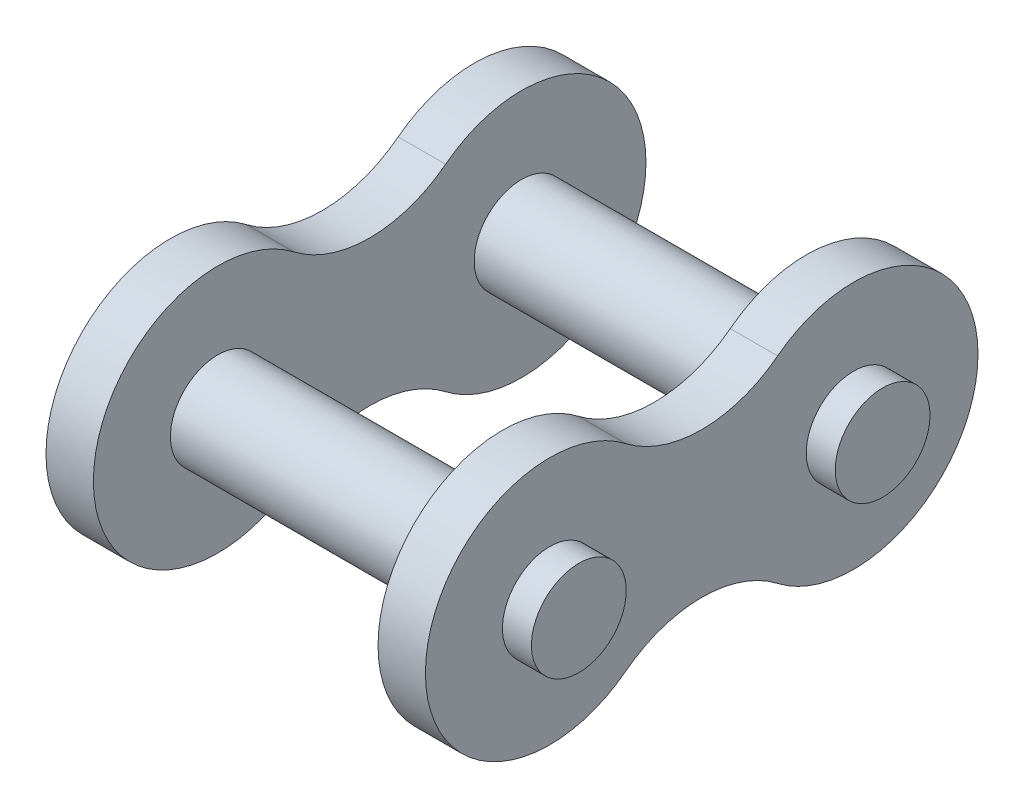
ISO-10303-21;
HEADER;
FILE_DESCRIPTION(('STEP AP214'),'2;1');
FILE_NAME('part.step','',(''),(''),'','','');
FILE_SCHEMA(('AUTOMOTIVE_DESIGN { 1 0 10303 214 1 1 1 1 }'));
ENDSEC;
DATA;
#1=APPLICATION_CONTEXT('core data for automotive mechanical design processes');
#2=APPLICATION_PROTOCOL_DEFINITION('international standard','automotive_design',2000,#1);
#3=PRODUCT_CONTEXT('',#1,'mechanical');
#4=PRODUCT('Part','Part','',(#3));
#5=PRODUCT_RELATED_PRODUCT_CATEGORY('part','',(#4));
#6=PRODUCT_DEFINITION_FORMATION('','',#4);
#7=PRODUCT_DEFINITION_CONTEXT('part definition',#1,'design');
#8=PRODUCT_DEFINITION('design','',#6,#7);
#9=PRODUCT_DEFINITION_SHAPE('','',#8);
#10=(LENGTH_UNIT() NAMED_UNIT(*) SI_UNIT(.MILLI.,.METRE.));
#11=(NAMED_UNIT(*) PLANE_ANGLE_UNIT() SI_UNIT($,.RADIAN.));
#12=(NAMED_UNIT(*) SI_UNIT($,.STERADIAN.) SOLID_ANGLE_UNIT());
#13=UNCERTAINTY_MEASURE_WITH_UNIT(LENGTH_MEASURE(1.E-05),#10,'distance_accuracy_value','');
#14=(GEOMETRIC_REPRESENTATION_CONTEXT(3) GLOBAL_UNCERTAINTY_ASSIGNED_CONTEXT((#13)) GLOBAL_UNIT_ASSIGNED_CONTEXT((#10,
#11,#12)) REPRESENTATION_CONTEXT('',''));
#15=CARTESIAN_POINT('',(0.,0.,0.));
#16=DIRECTION('',(0.,0.,1.));
#17=DIRECTION('',(1.,0.,0.));
#18=AXIS2_PLACEMENT_3D('',#15,#16,#17);
#19=CARTESIAN_POINT('',(-18.288,0.,12.7));
#20=DIRECTION('',(1.,0.,0.));
#21=DIRECTION('',(0.,0.,-1.));
#22=AXIS2_PLACEMENT_3D('',#19,#20,#21);
#23=CYLINDRICAL_SURFACE('',#22,3.9624);
#24=CARTESIAN_POINT('',(-18.288,0.,12.7));
#25=DIRECTION('',(1.,0.,0.));
#26=DIRECTION('',(0.,0.,-1.));
#27=AXIS2_PLACEMENT_3D('',#24,#25,#26);
#28=CIRCLE('',#27,3.9624);
#29=CARTESIAN_POINT('',(-18.288,0.,8.7376));
#30=VERTEX_POINT('',#29);
#31=EDGE_CURVE('E11',#30,#30,#28,.T.);
#32=ORIENTED_EDGE('',*,*,#31,.T.);
#33=EDGE_LOOP('',(#32));
#34=FACE_BOUND('',#33,.T.);
#35=CARTESIAN_POINT('',(18.288,0.,12.7));
#36=DIRECTION('',(1.,0.,0.));
#37=DIRECTION('',(0.,0.,-1.));
#38=AXIS2_PLACEMENT_3D('',#35,#36,#37);
#39=CIRCLE('',#38,3.9624);
#40=CARTESIAN_POINT('',(18.288,0.,8.7376));
#41=VERTEX_POINT('',#40);
#42=EDGE_CURVE('E55',#41,#41,#39,.T.);
#43=ORIENTED_EDGE('',*,*,#42,.F.);
#44=EDGE_LOOP('',(#43));
#45=FACE_BOUND('',#44,.T.);
#46=ADVANCED_FACE('F49',(#34,#45),#23,.T.);
#47=CARTESIAN_POINT('',(-18.288,0.,12.7));
#48=DIRECTION('',(1.,0.,0.));
#49=DIRECTION('',(0.,0.,-1.));
#50=AXIS2_PLACEMENT_3D('',#47,#48,#49);
#51=PLANE('',#50);
#52=ORIENTED_EDGE('',*,*,#31,.F.);
#53=EDGE_LOOP('',(#52));
#54=FACE_BOUND('',#53,.T.);
#55=ADVANCED_FACE('F65',(#54),#51,.F.);
#56=CARTESIAN_POINT('',(18.288,0.,12.7));
#57=DIRECTION('',(1.,0.,0.));
#58=DIRECTION('',(0.,0.,-1.));
#59=AXIS2_PLACEMENT_3D('',#56,#57,#58);
#60=PLANE('',#59);
#61=ORIENTED_EDGE('',*,*,#42,.T.);
#62=EDGE_LOOP('',(#61));
#63=FACE_BOUND('',#62,.T.);
#64=ADVANCED_FACE('F62',(#63),#60,.T.);
#65=CLOSED_SHELL('',(#46,#55,#64));
#66=MANIFOLD_SOLID_BREP('B2',#65);
#67=CARTESIAN_POINT('',(-18.288,0.,-12.7));
#68=DIRECTION('',(1.,0.,0.));
#69=DIRECTION('',(0.,0.,-1.));
#70=AXIS2_PLACEMENT_3D('',#67,#68,#69);
#71=CYLINDRICAL_SURFACE('',#70,3.9624);
#72=CARTESIAN_POINT('',(-18.288,0.,-12.7));
#73=DIRECTION('',(1.,0.,0.));
#74=DIRECTION('',(0.,0.,-1.));
#75=AXIS2_PLACEMENT_3D('',#72,#73,#74);
#76=CIRCLE('',#75,3.9624);
#77=CARTESIAN_POINT('',(-18.288,0.,-16.6624));
#78=VERTEX_POINT('',#77);
#79=EDGE_CURVE('E48',#78,#78,#76,.T.);
#80=ORIENTED_EDGE('',*,*,#79,.T.);
#81=EDGE_LOOP('',(#80));
#82=FACE_BOUND('',#81,.T.);
#83=CARTESIAN_POINT('',(18.288,0.,-12.7));
#84=DIRECTION('',(1.,0.,0.));
#85=DIRECTION('',(0.,0.,-1.));
#86=AXIS2_PLACEMENT_3D('',#83,#84,#85);
#87=CIRCLE('',#86,3.9624);
#88=CARTESIAN_POINT('',(18.288,0.,-16.6624));
#89=VERTEX_POINT('',#88);
#90=EDGE_CURVE('E106',#89,#89,#87,.T.);
#91=ORIENTED_EDGE('',*,*,#90,.F.);
#92=EDGE_LOOP('',(#91));
#93=FACE_BOUND('',#92,.T.);
#94=ADVANCED_FACE('F100',(#82,#93),#71,.T.);
#95=CARTESIAN_POINT('',(-18.288,0.,-12.7));
#96=DIRECTION('',(1.,0.,0.));
#97=DIRECTION('',(0.,0.,-1.));
#98=AXIS2_PLACEMENT_3D('',#95,#96,#97);
#99=PLANE('',#98);
#100=ORIENTED_EDGE('',*,*,#79,.F.);
#101=EDGE_LOOP('',(#100));
#102=FACE_BOUND('',#101,.T.);
#103=ADVANCED_FACE('F116',(#102),#99,.F.);
#104=CARTESIAN_POINT('',(18.288,0.,-12.7));
#105=DIRECTION('',(1.,0.,0.));
#106=DIRECTION('',(0.,0.,-1.));
#107=AXIS2_PLACEMENT_3D('',#104,#105,#106);
#108=PLANE('',#107);
#109=ORIENTED_EDGE('',*,*,#90,.T.);
#110=EDGE_LOOP('',(#109));
#111=FACE_BOUND('',#110,.T.);
#112=ADVANCED_FACE('F113',(#111),#108,.T.);
#113=CLOSED_SHELL('',(#94,#103,#112));
#114=MANIFOLD_SOLID_BREP('B6',#113);
#115=CARTESIAN_POINT('',(15.8623,-8.23799379035941,6.35));
#116=DIRECTION('',(1.,0.,0.));
#117=DIRECTION('',(0.,0.,-1.));
#118=AXIS2_PLACEMENT_3D('',#115,#116,#117);
#119=PLANE('',#118);
#120=CARTESIAN_POINT('',(15.8623,0.,12.7));
#121=DIRECTION('',(1.,0.,0.));
#122=DIRECTION('',(0.,0.,-1.));
#123=AXIS2_PLACEMENT_3D('',#120,#121,#122);
#124=CIRCLE('',#123,3.9624);
#125=CARTESIAN_POINT('',(15.8623,0.,8.7376));
#126=VERTEX_POINT('',#125);
#127=EDGE_CURVE('E223',#126,#126,#124,.T.);
#128=ORIENTED_EDGE('',*,*,#127,.F.);
#129=EDGE_LOOP('',(#128));
#130=FACE_BOUND('',#129,.T.);
#131=CARTESIAN_POINT('',(15.8623,0.,12.7));
#132=DIRECTION('',(1.,0.,0.));
#133=DIRECTION('',(0.,0.,-1.));
#134=AXIS2_PLACEMENT_3D('',#131,#132,#133);
#135=CIRCLE('',#134,10.4013);
#136=CARTESIAN_POINT('',(15.8623,8.23799379035938,6.35));
#137=VERTEX_POINT('',#136);
#138=CARTESIAN_POINT('',(15.8623,-8.23799379035941,6.35));
#139=VERTEX_POINT('',#138);
#140=EDGE_CURVE('E204',#137,#139,#135,.T.);
#141=ORIENTED_EDGE('',*,*,#140,.T.);
#142=CARTESIAN_POINT('',(15.8623,-16.4759875807188,0.));
#143=DIRECTION('',(-1.,0.,0.));
#144=DIRECTION('',(0.,0.,-1.));
#145=AXIS2_PLACEMENT_3D('',#142,#143,#144);
#146=CIRCLE('',#145,10.4013);
#147=CARTESIAN_POINT('',(15.8623,-8.23799379035941,-6.35));
#148=VERTEX_POINT('',#147);
#149=EDGE_CURVE('E199',#139,#148,#146,.T.);
#150=ORIENTED_EDGE('',*,*,#149,.T.);
#151=CARTESIAN_POINT('',(15.8623,0.,-12.7));
#152=DIRECTION('',(1.,0.,0.));
#153=DIRECTION('',(0.,0.,-1.));
#154=AXIS2_PLACEMENT_3D('',#151,#152,#153);
#155=CIRCLE('',#154,10.4013);
#156=CARTESIAN_POINT('',(15.8623,8.23799379035939,-6.35));
#157=VERTEX_POINT('',#156);
#158=EDGE_CURVE('E202',#148,#157,#155,.T.);
#159=ORIENTED_EDGE('',*,*,#158,.T.);
#160=CARTESIAN_POINT('',(15.8623,16.4759875807188,0.));
#161=DIRECTION('',(-1.,0.,0.));
#162=DIRECTION('',(0.,0.,-1.));
#163=AXIS2_PLACEMENT_3D('',#160,#161,#162);
#164=CIRCLE('',#163,10.4013);
#165=EDGE_CURVE('E169',#157,#137,#164,.T.);
#166=ORIENTED_EDGE('',*,*,#165,.T.);
#167=EDGE_LOOP('',(#141,#150,#159,#166));
#168=FACE_BOUND('',#167,.T.);
#169=CARTESIAN_POINT('',(15.8623,0.,-12.7));
#170=DIRECTION('',(1.,0.,0.));
#171=DIRECTION('',(0.,0.,-1.));
#172=AXIS2_PLACEMENT_3D('',#169,#170,#171);
#173=CIRCLE('',#172,3.9624);
#174=CARTESIAN_POINT('',(15.8623,0.,-16.6624));
#175=VERTEX_POINT('',#174);
#176=EDGE_CURVE('E242',#175,#175,#173,.T.);
#177=ORIENTED_EDGE('',*,*,#176,.F.);
#178=EDGE_LOOP('',(#177));
#179=FACE_BOUND('',#178,.T.);
#180=ADVANCED_FACE('F152',(#130,#168,#179),#119,.T.);
#181=CARTESIAN_POINT('',(11.8999,-8.23799379035941,6.35));
#182=DIRECTION('',(1.,0.,0.));
#183=DIRECTION('',(0.,0.,-1.));
#184=AXIS2_PLACEMENT_3D('',#181,#182,#183);
#185=PLANE('',#184);
#186=CARTESIAN_POINT('',(11.8999,0.,12.7));
#187=DIRECTION('',(1.,0.,0.));
#188=DIRECTION('',(0.,0.,-1.));
#189=AXIS2_PLACEMENT_3D('',#186,#187,#188);
#190=CIRCLE('',#189,3.9624);
#191=CARTESIAN_POINT('',(11.8999,0.,8.7376));
#192=VERTEX_POINT('',#191);
#193=EDGE_CURVE('E238',#192,#192,#190,.T.);
#194=ORIENTED_EDGE('',*,*,#193,.T.);
#195=EDGE_LOOP('',(#194));
#196=FACE_BOUND('',#195,.T.);
#197=CARTESIAN_POINT('',(11.8999,0.,12.7));
#198=DIRECTION('',(1.,0.,0.));
#199=DIRECTION('',(0.,0.,-1.));
#200=AXIS2_PLACEMENT_3D('',#197,#198,#199);
#201=CIRCLE('',#200,10.4013);
#202=CARTESIAN_POINT('',(11.8999,8.23799379035938,6.35));
#203=VERTEX_POINT('',#202);
#204=CARTESIAN_POINT('',(11.8999,-8.23799379035941,6.35));
#205=VERTEX_POINT('',#204);
#206=EDGE_CURVE('E219',#203,#205,#201,.T.);
#207=ORIENTED_EDGE('',*,*,#206,.F.);
#208=CARTESIAN_POINT('',(11.8999,16.4759875807188,0.));
#209=DIRECTION('',(-1.,0.,0.));
#210=DIRECTION('',(0.,0.,-1.));
#211=AXIS2_PLACEMENT_3D('',#208,#209,#210);
#212=CIRCLE('',#211,10.4013);
#213=CARTESIAN_POINT('',(11.8999,8.23799379035939,-6.35));
#214=VERTEX_POINT('',#213);
#215=EDGE_CURVE('E192',#214,#203,#212,.T.);
#216=ORIENTED_EDGE('',*,*,#215,.F.);
#217=CARTESIAN_POINT('',(11.8999,0.,-12.7));
#218=DIRECTION('',(1.,0.,0.));
#219=DIRECTION('',(0.,0.,-1.));
#220=AXIS2_PLACEMENT_3D('',#217,#218,#219);
#221=CIRCLE('',#220,10.4013);
#222=CARTESIAN_POINT('',(11.8999,-8.23799379035941,-6.35));
#223=VERTEX_POINT('',#222);
#224=EDGE_CURVE('E186',#223,#214,#221,.T.);
#225=ORIENTED_EDGE('',*,*,#224,.F.);
#226=CARTESIAN_POINT('',(11.8999,-16.4759875807188,0.));
#227=DIRECTION('',(-1.,0.,0.));
#228=DIRECTION('',(0.,0.,-1.));
#229=AXIS2_PLACEMENT_3D('',#226,#227,#228);
#230=CIRCLE('',#229,10.4013);
#231=EDGE_CURVE('E208',#205,#223,#230,.T.);
#232=ORIENTED_EDGE('',*,*,#231,.F.);
#233=EDGE_LOOP('',(#207,#216,#225,#232));
#234=FACE_BOUND('',#233,.T.);
#235=CARTESIAN_POINT('',(11.8999,0.,-12.7));
#236=DIRECTION('',(1.,0.,0.));
#237=DIRECTION('',(0.,0.,-1.));
#238=AXIS2_PLACEMENT_3D('',#235,#236,#237);
#239=CIRCLE('',#238,3.9624);
#240=CARTESIAN_POINT('',(11.8999,0.,-16.6624));
#241=VERTEX_POINT('',#240);
#242=EDGE_CURVE('E245',#241,#241,#239,.T.);
#243=ORIENTED_EDGE('',*,*,#242,.T.);
#244=EDGE_LOOP('',(#243));
#245=FACE_BOUND('',#244,.T.);
#246=ADVANCED_FACE('F232',(#196,#234,#245),#185,.F.);
#247=CARTESIAN_POINT('',(15.8623,0.,12.7));
#248=DIRECTION('',(-1.,0.,0.));
#249=DIRECTION('',(0.,0.,1.));
#250=AXIS2_PLACEMENT_3D('',#247,#248,#249);
#251=CYLINDRICAL_SURFACE('',#250,10.4013);
#252=ORIENTED_EDGE('',*,*,#206,.T.);
#253=DIRECTION('',(-1.,0.,0.));
#254=VECTOR('',#253,1.);
#255=CARTESIAN_POINT('',(15.8623,-8.23799379035941,6.35));
#256=LINE('',#255,#254);
#257=EDGE_CURVE('E98',#139,#205,#256,.T.);
#258=ORIENTED_EDGE('',*,*,#257,.F.);
#259=ORIENTED_EDGE('',*,*,#140,.F.);
#260=DIRECTION('',(-1.,0.,0.));
#261=VECTOR('',#260,1.);
#262=CARTESIAN_POINT('',(15.8623,8.23799379035938,6.35));
#263=LINE('',#262,#261);
#264=EDGE_CURVE('E215',#137,#203,#263,.T.);
#265=ORIENTED_EDGE('',*,*,#264,.T.);
#266=EDGE_LOOP('',(#252,#258,#259,#265));
#267=FACE_BOUND('',#266,.T.);
#268=ADVANCED_FACE('F154',(#267),#251,.T.);
#269=CARTESIAN_POINT('',(15.8623,-16.4759875807188,0.));
#270=DIRECTION('',(-1.,0.,0.));
#271=DIRECTION('',(0.,0.,1.));
#272=AXIS2_PLACEMENT_3D('',#269,#270,#271);
#273=CYLINDRICAL_SURFACE('',#272,10.4013);
#274=ORIENTED_EDGE('',*,*,#231,.T.);
#275=DIRECTION('',(-1.,0.,0.));
#276=VECTOR('',#275,1.);
#277=CARTESIAN_POINT('',(15.8623,-8.23799379035941,-6.35));
#278=LINE('',#277,#276);
#279=EDGE_CURVE('E161',#148,#223,#278,.T.);
#280=ORIENTED_EDGE('',*,*,#279,.F.);
#281=ORIENTED_EDGE('',*,*,#149,.F.);
#282=ORIENTED_EDGE('',*,*,#257,.T.);
#283=EDGE_LOOP('',(#274,#280,#281,#282));
#284=FACE_BOUND('',#283,.T.);
#285=ADVANCED_FACE('F207',(#284),#273,.F.);
#286=CARTESIAN_POINT('',(15.8623,0.,-12.7));
#287=DIRECTION('',(-1.,0.,0.));
#288=DIRECTION('',(0.,0.,1.));
#289=AXIS2_PLACEMENT_3D('',#286,#287,#288);
#290=CYLINDRICAL_SURFACE('',#289,10.4013);
#291=ORIENTED_EDGE('',*,*,#224,.T.);
#292=DIRECTION('',(-1.,0.,0.));
#293=VECTOR('',#292,1.);
#294=CARTESIAN_POINT('',(15.8623,8.23799379035939,-6.35));
#295=LINE('',#294,#293);
#296=EDGE_CURVE('E209',#157,#214,#295,.T.);
#297=ORIENTED_EDGE('',*,*,#296,.F.);
#298=ORIENTED_EDGE('',*,*,#158,.F.);
#299=ORIENTED_EDGE('',*,*,#279,.T.);
#300=EDGE_LOOP('',(#291,#297,#298,#299));
#301=FACE_BOUND('',#300,.T.);
#302=ADVANCED_FACE('F210',(#301),#290,.T.);
#303=CARTESIAN_POINT('',(15.8623,16.4759875807188,0.));
#304=DIRECTION('',(-1.,0.,0.));
#305=DIRECTION('',(0.,0.,1.));
#306=AXIS2_PLACEMENT_3D('',#303,#304,#305);
#307=CYLINDRICAL_SURFACE('',#306,10.4013);
#308=ORIENTED_EDGE('',*,*,#215,.T.);
#309=ORIENTED_EDGE('',*,*,#264,.F.);
#310=ORIENTED_EDGE('',*,*,#165,.F.);
#311=ORIENTED_EDGE('',*,*,#296,.T.);
#312=EDGE_LOOP('',(#308,#309,#310,#311));
#313=FACE_BOUND('',#312,.T.);
#314=ADVANCED_FACE('F229',(#313),#307,.F.);
#315=CARTESIAN_POINT('',(15.8623,0.,12.7));
#316=DIRECTION('',(-1.,0.,0.));
#317=DIRECTION('',(0.,0.,1.));
#318=AXIS2_PLACEMENT_3D('',#315,#316,#317);
#319=CYLINDRICAL_SURFACE('',#318,3.9624);
#320=ORIENTED_EDGE('',*,*,#127,.T.);
#321=EDGE_LOOP('',(#320));
#322=FACE_BOUND('',#321,.T.);
#323=ORIENTED_EDGE('',*,*,#193,.F.);
#324=EDGE_LOOP('',(#323));
#325=FACE_BOUND('',#324,.T.);
#326=ADVANCED_FACE('F263',(#322,#325),#319,.F.);
#327=CARTESIAN_POINT('',(15.8623,0.,-12.7));
#328=DIRECTION('',(-1.,0.,0.));
#329=DIRECTION('',(0.,0.,1.));
#330=AXIS2_PLACEMENT_3D('',#327,#328,#329);
#331=CYLINDRICAL_SURFACE('',#330,3.9624);
#332=ORIENTED_EDGE('',*,*,#176,.T.);
#333=EDGE_LOOP('',(#332));
#334=FACE_BOUND('',#333,.T.);
#335=ORIENTED_EDGE('',*,*,#242,.F.);
#336=EDGE_LOOP('',(#335));
#337=FACE_BOUND('',#336,.T.);
#338=ADVANCED_FACE('F251',(#334,#337),#331,.F.);
#339=CLOSED_SHELL('',(#180,#246,#268,#285,#302,#314,#326,#338));
#340=MANIFOLD_SOLID_BREP('B43',#339);
#341=CARTESIAN_POINT('',(-15.8623,16.4759875807188,0.));
#342=DIRECTION('',(1.,0.,0.));
#343=DIRECTION('',(0.,0.,-1.));
#344=AXIS2_PLACEMENT_3D('',#341,#342,#343);
#345=CYLINDRICAL_SURFACE('',#344,10.4013);
#346=CARTESIAN_POINT('',(-11.8999,16.4759875807188,0.));
#347=DIRECTION('',(-1.,0.,0.));
#348=DIRECTION('',(0.,0.,1.));
#349=AXIS2_PLACEMENT_3D('',#346,#347,#348);
#350=CIRCLE('',#349,10.4013);
#351=CARTESIAN_POINT('',(-11.8999,8.23799379035939,-6.35));
#352=VERTEX_POINT('',#351);
#353=CARTESIAN_POINT('',(-11.8999,8.23799379035939,6.35));
#354=VERTEX_POINT('',#353);
#355=EDGE_CURVE('E398',#352,#354,#350,.T.);
#356=ORIENTED_EDGE('',*,*,#355,.F.);
#357=DIRECTION('',(1.,0.,0.));
#358=VECTOR('',#357,1.);
#359=CARTESIAN_POINT('',(-15.8623,8.23799379035939,-6.35));
#360=LINE('',#359,#358);
#361=CARTESIAN_POINT('',(-15.8623,8.23799379035939,-6.35));
#362=VERTEX_POINT('',#361);
#363=EDGE_CURVE('E150',#362,#352,#360,.T.);
#364=ORIENTED_EDGE('',*,*,#363,.F.);
#365=CARTESIAN_POINT('',(-15.8623,16.4759875807188,0.));
#366=DIRECTION('',(-1.,0.,0.));
#367=DIRECTION('',(0.,0.,1.));
#368=AXIS2_PLACEMENT_3D('',#365,#366,#367);
#369=CIRCLE('',#368,10.4013);
#370=CARTESIAN_POINT('',(-15.8623,8.23799379035939,6.35));
#371=VERTEX_POINT('',#370);
#372=EDGE_CURVE('E390',#362,#371,#369,.T.);
#373=ORIENTED_EDGE('',*,*,#372,.T.);
#374=DIRECTION('',(1.,0.,0.));
#375=VECTOR('',#374,1.);
#376=CARTESIAN_POINT('',(-15.8623,8.23799379035939,6.35));
#377=LINE('',#376,#375);
#378=EDGE_CURVE('E331',#371,#354,#377,.T.);
#379=ORIENTED_EDGE('',*,*,#378,.T.);
#380=EDGE_LOOP('',(#356,#364,#373,#379));
#381=FACE_BOUND('',#380,.T.);
#382=ADVANCED_FACE('F328',(#381),#345,.F.);
#383=CARTESIAN_POINT('',(-15.8623,0.,-12.7));
#384=DIRECTION('',(1.,0.,0.));
#385=DIRECTION('',(0.,0.,-1.));
#386=AXIS2_PLACEMENT_3D('',#383,#384,#385);
#387=CYLINDRICAL_SURFACE('',#386,10.4013);
#388=CARTESIAN_POINT('',(-11.8999,0.,-12.7));
#389=DIRECTION('',(1.,0.,0.));
#390=DIRECTION('',(0.,0.,-1.));
#391=AXIS2_PLACEMENT_3D('',#388,#389,#390);
#392=CIRCLE('',#391,10.4013);
#393=CARTESIAN_POINT('',(-11.8999,-8.23799379035941,-6.35));
#394=VERTEX_POINT('',#393);
#395=EDGE_CURVE('E392',#394,#352,#392,.T.);
#396=ORIENTED_EDGE('',*,*,#395,.F.);
#397=DIRECTION('',(1.,0.,0.));
#398=VECTOR('',#397,1.);
#399=CARTESIAN_POINT('',(-15.8623,-8.23799379035941,-6.35));
#400=LINE('',#399,#398);
#401=CARTESIAN_POINT('',(-15.8623,-8.23799379035941,-6.35));
#402=VERTEX_POINT('',#401);
#403=EDGE_CURVE('E337',#402,#394,#400,.T.);
#404=ORIENTED_EDGE('',*,*,#403,.F.);
#405=CARTESIAN_POINT('',(-15.8623,0.,-12.7));
#406=DIRECTION('',(1.,0.,0.));
#407=DIRECTION('',(0.,0.,-1.));
#408=AXIS2_PLACEMENT_3D('',#405,#406,#407);
#409=CIRCLE('',#408,10.4013);
#410=EDGE_CURVE('E386',#402,#362,#409,.T.);
#411=ORIENTED_EDGE('',*,*,#410,.T.);
#412=ORIENTED_EDGE('',*,*,#363,.T.);
#413=EDGE_LOOP('',(#396,#404,#411,#412));
#414=FACE_BOUND('',#413,.T.);
#415=ADVANCED_FACE('F413',(#414),#387,.T.);
#416=CARTESIAN_POINT('',(-15.8623,-16.4759875807188,0.));
#417=DIRECTION('',(1.,0.,0.));
#418=DIRECTION('',(0.,0.,-1.));
#419=AXIS2_PLACEMENT_3D('',#416,#417,#418);
#420=CYLINDRICAL_SURFACE('',#419,10.4013);
#421=CARTESIAN_POINT('',(-11.8999,-16.4759875807188,0.));
#422=DIRECTION('',(-1.,0.,0.));
#423=DIRECTION('',(0.,0.,1.));
#424=AXIS2_PLACEMENT_3D('',#421,#422,#423);
#425=CIRCLE('',#424,10.4013);
#426=CARTESIAN_POINT('',(-11.8999,-8.23799379035941,6.35000000000001));
#427=VERTEX_POINT('',#426);
#428=EDGE_CURVE('E380',#427,#394,#425,.T.);
#429=ORIENTED_EDGE('',*,*,#428,.F.);
#430=DIRECTION('',(1.,0.,0.));
#431=VECTOR('',#430,1.);
#432=CARTESIAN_POINT('',(-15.8623,-8.23799379035941,6.35000000000001));
#433=LINE('',#432,#431);
#434=CARTESIAN_POINT('',(-15.8623,-8.23799379035941,6.35000000000001));
#435=VERTEX_POINT('',#434);
#436=EDGE_CURVE('E375',#435,#427,#433,.T.);
#437=ORIENTED_EDGE('',*,*,#436,.F.);
#438=CARTESIAN_POINT('',(-15.8623,-16.4759875807188,0.));
#439=DIRECTION('',(-1.,0.,0.));
#440=DIRECTION('',(0.,0.,1.));
#441=AXIS2_PLACEMENT_3D('',#438,#439,#440);
#442=CIRCLE('',#441,10.4013);
#443=EDGE_CURVE('E378',#435,#402,#442,.T.);
#444=ORIENTED_EDGE('',*,*,#443,.T.);
#445=ORIENTED_EDGE('',*,*,#403,.T.);
#446=EDGE_LOOP('',(#429,#437,#444,#445));
#447=FACE_BOUND('',#446,.T.);
#448=ADVANCED_FACE('F377',(#447),#420,.F.);
#449=CARTESIAN_POINT('',(-15.8623,0.,12.7));
#450=DIRECTION('',(1.,0.,0.));
#451=DIRECTION('',(0.,0.,-1.));
#452=AXIS2_PLACEMENT_3D('',#449,#450,#451);
#453=CYLINDRICAL_SURFACE('',#452,10.4013);
#454=CARTESIAN_POINT('',(-11.8999,0.,12.7));
#455=DIRECTION('',(1.,0.,0.));
#456=DIRECTION('',(0.,0.,-1.));
#457=AXIS2_PLACEMENT_3D('',#454,#455,#456);
#458=CIRCLE('',#457,10.4013);
#459=EDGE_CURVE('E401',#354,#427,#458,.T.);
#460=ORIENTED_EDGE('',*,*,#459,.F.);
#461=ORIENTED_EDGE('',*,*,#378,.F.);
#462=CARTESIAN_POINT('',(-15.8623,0.,12.7));
#463=DIRECTION('',(1.,0.,0.));
#464=DIRECTION('',(0.,0.,-1.));
#465=AXIS2_PLACEMENT_3D('',#462,#463,#464);
#466=CIRCLE('',#465,10.4013);
#467=EDGE_CURVE('E385',#371,#435,#466,.T.);
#468=ORIENTED_EDGE('',*,*,#467,.T.);
#469=ORIENTED_EDGE('',*,*,#436,.T.);
#470=EDGE_LOOP('',(#460,#461,#468,#469));
#471=FACE_BOUND('',#470,.T.);
#472=ADVANCED_FACE('F389',(#471),#453,.T.);
#473=CARTESIAN_POINT('',(-15.8623,8.23799379035939,6.35));
#474=DIRECTION('',(-1.,0.,0.));
#475=DIRECTION('',(0.,0.,1.));
#476=AXIS2_PLACEMENT_3D('',#473,#474,#475);
#477=PLANE('',#476);
#478=CARTESIAN_POINT('',(-15.8623,0.,-12.7));
#479=DIRECTION('',(1.,0.,0.));
#480=DIRECTION('',(0.,0.,-1.));
#481=AXIS2_PLACEMENT_3D('',#478,#479,#480);
#482=CIRCLE('',#481,3.9624);
#483=CARTESIAN_POINT('',(-15.8623,0.,-16.6624));
#484=VERTEX_POINT('',#483);
#485=EDGE_CURVE('E446',#484,#484,#482,.T.);
#486=ORIENTED_EDGE('',*,*,#485,.T.);
#487=EDGE_LOOP('',(#486));
#488=FACE_BOUND('',#487,.T.);
#489=CARTESIAN_POINT('',(-15.8623,0.,12.7));
#490=DIRECTION('',(1.,0.,0.));
#491=DIRECTION('',(0.,0.,-1.));
#492=AXIS2_PLACEMENT_3D('',#489,#490,#491);
#493=CIRCLE('',#492,3.9624);
#494=CARTESIAN_POINT('',(-15.8623,0.,8.7376));
#495=VERTEX_POINT('',#494);
#496=EDGE_CURVE('E402',#495,#495,#493,.T.);
#497=ORIENTED_EDGE('',*,*,#496,.T.);
#498=EDGE_LOOP('',(#497));
#499=FACE_BOUND('',#498,.T.);
#500=ORIENTED_EDGE('',*,*,#372,.F.);
#501=ORIENTED_EDGE('',*,*,#410,.F.);
#502=ORIENTED_EDGE('',*,*,#443,.F.);
#503=ORIENTED_EDGE('',*,*,#467,.F.);
#504=EDGE_LOOP('',(#500,#501,#502,#503));
#505=FACE_BOUND('',#504,.T.);
#506=ADVANCED_FACE('F384',(#488,#499,#505),#477,.T.);
#507=CARTESIAN_POINT('',(-11.8999,8.23799379035939,6.35));
#508=DIRECTION('',(-1.,0.,0.));
#509=DIRECTION('',(0.,0.,1.));
#510=AXIS2_PLACEMENT_3D('',#507,#508,#509);
#511=PLANE('',#510);
#512=CARTESIAN_POINT('',(-11.8999,0.,-12.7));
#513=DIRECTION('',(1.,0.,0.));
#514=DIRECTION('',(0.,0.,-1.));
#515=AXIS2_PLACEMENT_3D('',#512,#513,#514);
#516=CIRCLE('',#515,3.9624);
#517=CARTESIAN_POINT('',(-11.8999,0.,-16.6624));
#518=VERTEX_POINT('',#517);
#519=EDGE_CURVE('E449',#518,#518,#516,.T.);
#520=ORIENTED_EDGE('',*,*,#519,.F.);
#521=EDGE_LOOP('',(#520));
#522=FACE_BOUND('',#521,.T.);
#523=CARTESIAN_POINT('',(-11.8999,0.,12.7));
#524=DIRECTION('',(1.,0.,0.));
#525=DIRECTION('',(0.,0.,-1.));
#526=AXIS2_PLACEMENT_3D('',#523,#524,#525);
#527=CIRCLE('',#526,3.9624);
#528=CARTESIAN_POINT('',(-11.8999,0.,8.7376));
#529=VERTEX_POINT('',#528);
#530=EDGE_CURVE('E451',#529,#529,#527,.T.);
#531=ORIENTED_EDGE('',*,*,#530,.F.);
#532=EDGE_LOOP('',(#531));
#533=FACE_BOUND('',#532,.T.);
#534=ORIENTED_EDGE('',*,*,#355,.T.);
#535=ORIENTED_EDGE('',*,*,#459,.T.);
#536=ORIENTED_EDGE('',*,*,#428,.T.);
#537=ORIENTED_EDGE('',*,*,#395,.T.);
#538=EDGE_LOOP('',(#534,#535,#536,#537));
#539=FACE_BOUND('',#538,.T.);
#540=ADVANCED_FACE('F412',(#522,#533,#539),#511,.F.);
#541=CARTESIAN_POINT('',(-15.8623,0.,12.7));
#542=DIRECTION('',(1.,0.,0.));
#543=DIRECTION('',(0.,0.,-1.));
#544=AXIS2_PLACEMENT_3D('',#541,#542,#543);
#545=CYLINDRICAL_SURFACE('',#544,3.9624);
#546=ORIENTED_EDGE('',*,*,#496,.F.);
#547=EDGE_LOOP('',(#546));
#548=FACE_BOUND('',#547,.T.);
#549=ORIENTED_EDGE('',*,*,#530,.T.);
#550=EDGE_LOOP('',(#549));
#551=FACE_BOUND('',#550,.T.);
#552=ADVANCED_FACE('F431',(#548,#551),#545,.F.);
#553=CARTESIAN_POINT('',(-15.8623,0.,-12.7));
#554=DIRECTION('',(1.,0.,0.));
#555=DIRECTION('',(0.,0.,-1.));
#556=AXIS2_PLACEMENT_3D('',#553,#554,#555);
#557=CYLINDRICAL_SURFACE('',#556,3.9624);
#558=ORIENTED_EDGE('',*,*,#485,.F.);
#559=EDGE_LOOP('',(#558));
#560=FACE_BOUND('',#559,.T.);
#561=ORIENTED_EDGE('',*,*,#519,.T.);
#562=EDGE_LOOP('',(#561));
#563=FACE_BOUND('',#562,.T.);
#564=ADVANCED_FACE('F438',(#560,#563),#557,.F.);
#565=CLOSED_SHELL('',(#382,#415,#448,#472,#506,#540,#552,#564));
#566=MANIFOLD_SOLID_BREP('B92',#565);
#567=ADVANCED_BREP_SHAPE_REPRESENTATION('',(#18,#66,#114,#340,#566),#14);
#568=SHAPE_DEFINITION_REPRESENTATION(#9,#567);
ENDSEC;
END-ISO-10303-21;
